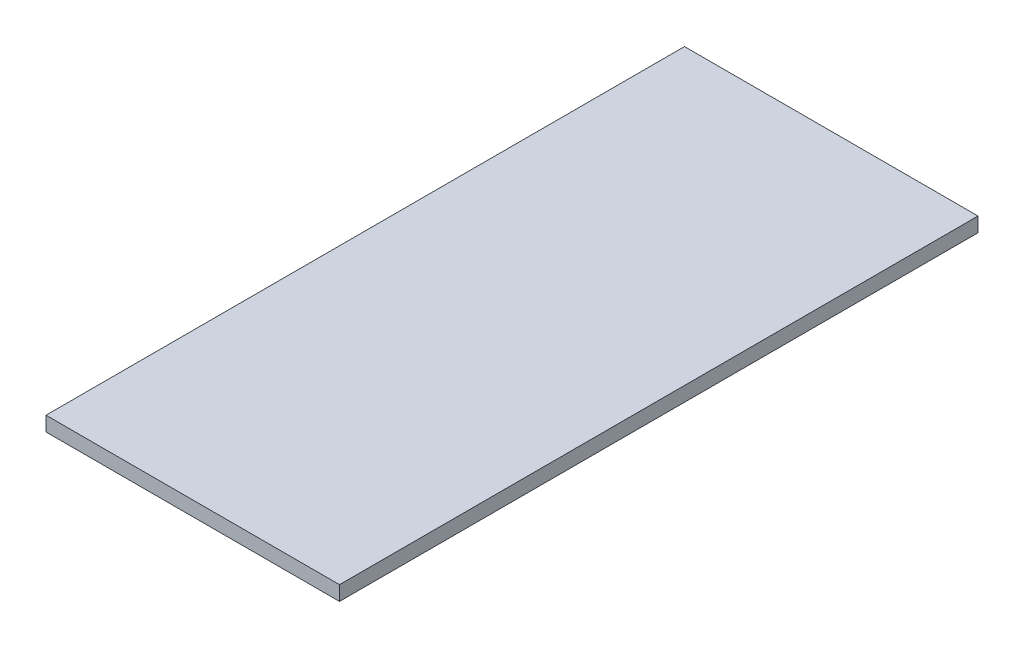
ISO-10303-21;
HEADER;
FILE_DESCRIPTION(('STEP AP214'),'2;1');
FILE_NAME('part.step','',(''),(''),'','','');
FILE_SCHEMA(('AUTOMOTIVE_DESIGN { 1 0 10303 214 1 1 1 1 }'));
ENDSEC;
DATA;
#1=APPLICATION_CONTEXT('core data for automotive mechanical design processes');
#2=APPLICATION_PROTOCOL_DEFINITION('international standard','automotive_design',2000,#1);
#3=PRODUCT_CONTEXT('',#1,'mechanical');
#4=PRODUCT('Part','Part','',(#3));
#5=PRODUCT_RELATED_PRODUCT_CATEGORY('part','',(#4));
#6=PRODUCT_DEFINITION_FORMATION('','',#4);
#7=PRODUCT_DEFINITION_CONTEXT('part definition',#1,'design');
#8=PRODUCT_DEFINITION('design','',#6,#7);
#9=PRODUCT_DEFINITION_SHAPE('','',#8);
#10=(LENGTH_UNIT() NAMED_UNIT(*) SI_UNIT(.MILLI.,.METRE.));
#11=(NAMED_UNIT(*) PLANE_ANGLE_UNIT() SI_UNIT($,.RADIAN.));
#12=(NAMED_UNIT(*) SI_UNIT($,.STERADIAN.) SOLID_ANGLE_UNIT());
#13=UNCERTAINTY_MEASURE_WITH_UNIT(LENGTH_MEASURE(1.E-05),#10,'distance_accuracy_value','');
#14=(GEOMETRIC_REPRESENTATION_CONTEXT(3) GLOBAL_UNCERTAINTY_ASSIGNED_CONTEXT((#13)) GLOBAL_UNIT_ASSIGNED_CONTEXT((#10,
#11,#12)) REPRESENTATION_CONTEXT('',''));
#15=CARTESIAN_POINT('',(0.,0.,0.));
#16=DIRECTION('',(0.,0.,1.));
#17=DIRECTION('',(1.,0.,0.));
#18=AXIS2_PLACEMENT_3D('',#15,#16,#17);
#19=CARTESIAN_POINT('',(-102.69958830056,28.6047144668192,49.1767098548853));
#20=DIRECTION('',(1.,0.,0.));
#21=DIRECTION('',(0.,1.,0.));
#22=AXIS2_PLACEMENT_3D('',#19,#20,#21);
#23=PLANE('',#22);
#24=DIRECTION('',(0.,0.,-1.));
#25=VECTOR('',#24,1.);
#26=CARTESIAN_POINT('',(-102.69958830056,39.6047144668192,49.1767098548853));
#27=LINE('',#26,#25);
#28=CARTESIAN_POINT('',(-102.69958830056,39.6047144668189,531.998452869963));
#29=VERTEX_POINT('',#28);
#30=CARTESIAN_POINT('',(-102.69958830056,39.6047144668192,49.1767098548853));
#31=VERTEX_POINT('',#30);
#32=EDGE_CURVE('E96',#29,#31,#27,.T.);
#33=ORIENTED_EDGE('',*,*,#32,.T.);
#34=DIRECTION('',(0.,1.,0.));
#35=VECTOR('',#34,1.);
#36=CARTESIAN_POINT('',(-102.69958830056,28.6047144668192,49.1767098548853));
#37=LINE('',#36,#35);
#38=CARTESIAN_POINT('',(-102.69958830056,28.6047144668192,49.1767098548853));
#39=VERTEX_POINT('',#38);
#40=EDGE_CURVE('E11',#39,#31,#37,.T.);
#41=ORIENTED_EDGE('',*,*,#40,.F.);
#42=DIRECTION('',(0.,0.,-1.));
#43=VECTOR('',#42,1.);
#44=CARTESIAN_POINT('',(-102.69958830056,28.6047144668192,49.1767098548853));
#45=LINE('',#44,#43);
#46=CARTESIAN_POINT('',(-102.69958830056,28.6047144668189,531.998452869963));
#47=VERTEX_POINT('',#46);
#48=EDGE_CURVE('E84',#47,#39,#45,.T.);
#49=ORIENTED_EDGE('',*,*,#48,.F.);
#50=DIRECTION('',(0.,1.,0.));
#51=VECTOR('',#50,1.);
#52=CARTESIAN_POINT('',(-102.69958830056,28.6047144668189,531.998452869963));
#53=LINE('',#52,#51);
#54=EDGE_CURVE('E92',#47,#29,#53,.T.);
#55=ORIENTED_EDGE('',*,*,#54,.T.);
#56=EDGE_LOOP('',(#33,#41,#49,#55));
#57=FACE_BOUND('',#56,.T.);
#58=ADVANCED_FACE('F33',(#57),#23,.F.);
#59=CARTESIAN_POINT('',(-102.69958830056,28.6047144668192,49.1767098548853));
#60=DIRECTION('',(0.,0.,1.));
#61=DIRECTION('',(0.,-1.,0.));
#62=AXIS2_PLACEMENT_3D('',#59,#60,#61);
#63=PLANE('',#62);
#64=DIRECTION('',(1.,0.,0.));
#65=VECTOR('',#64,1.);
#66=CARTESIAN_POINT('',(-102.69958830056,39.6047144668192,49.1767098548853));
#67=LINE('',#66,#65);
#68=CARTESIAN_POINT('',(119.23441331911,39.6047144668192,49.1767098548853));
#69=VERTEX_POINT('',#68);
#70=EDGE_CURVE('E88',#31,#69,#67,.T.);
#71=ORIENTED_EDGE('',*,*,#70,.T.);
#72=DIRECTION('',(0.,1.,0.));
#73=VECTOR('',#72,1.);
#74=CARTESIAN_POINT('',(119.23441331911,28.6047144668192,49.1767098548853));
#75=LINE('',#74,#73);
#76=CARTESIAN_POINT('',(119.23441331911,28.6047144668192,49.1767098548853));
#77=VERTEX_POINT('',#76);
#78=EDGE_CURVE('E41',#77,#69,#75,.T.);
#79=ORIENTED_EDGE('',*,*,#78,.F.);
#80=DIRECTION('',(1.,0.,0.));
#81=VECTOR('',#80,1.);
#82=CARTESIAN_POINT('',(-102.69958830056,28.6047144668192,49.1767098548853));
#83=LINE('',#82,#81);
#84=EDGE_CURVE('E79',#39,#77,#83,.T.);
#85=ORIENTED_EDGE('',*,*,#84,.F.);
#86=ORIENTED_EDGE('',*,*,#40,.T.);
#87=EDGE_LOOP('',(#71,#79,#85,#86));
#88=FACE_BOUND('',#87,.T.);
#89=ADVANCED_FACE('F87',(#88),#63,.F.);
#90=CARTESIAN_POINT('',(119.23441331911,28.6047144668192,49.1767098548853));
#91=DIRECTION('',(-1.,0.,0.));
#92=DIRECTION('',(0.,-1.,0.));
#93=AXIS2_PLACEMENT_3D('',#90,#91,#92);
#94=PLANE('',#93);
#95=DIRECTION('',(0.,0.,1.));
#96=VECTOR('',#95,1.);
#97=CARTESIAN_POINT('',(119.23441331911,39.6047144668192,49.1767098548853));
#98=LINE('',#97,#96);
#99=CARTESIAN_POINT('',(119.23441331911,39.604714466819,531.998452869963));
#100=VERTEX_POINT('',#99);
#101=EDGE_CURVE('E66',#69,#100,#98,.T.);
#102=ORIENTED_EDGE('',*,*,#101,.T.);
#103=DIRECTION('',(0.,1.,0.));
#104=VECTOR('',#103,1.);
#105=CARTESIAN_POINT('',(119.23441331911,28.604714466819,531.998452869963));
#106=LINE('',#105,#104);
#107=CARTESIAN_POINT('',(119.23441331911,28.604714466819,531.998452869963));
#108=VERTEX_POINT('',#107);
#109=EDGE_CURVE('E89',#108,#100,#106,.T.);
#110=ORIENTED_EDGE('',*,*,#109,.F.);
#111=DIRECTION('',(0.,0.,1.));
#112=VECTOR('',#111,1.);
#113=CARTESIAN_POINT('',(119.23441331911,28.6047144668192,49.1767098548853));
#114=LINE('',#113,#112);
#115=EDGE_CURVE('E82',#77,#108,#114,.T.);
#116=ORIENTED_EDGE('',*,*,#115,.F.);
#117=ORIENTED_EDGE('',*,*,#78,.T.);
#118=EDGE_LOOP('',(#102,#110,#116,#117));
#119=FACE_BOUND('',#118,.T.);
#120=ADVANCED_FACE('F90',(#119),#94,.F.);
#121=CARTESIAN_POINT('',(-102.69958830056,28.6047144668189,531.998452869963));
#122=DIRECTION('',(0.,0.,-1.));
#123=DIRECTION('',(0.,1.,0.));
#124=AXIS2_PLACEMENT_3D('',#121,#122,#123);
#125=PLANE('',#124);
#126=DIRECTION('',(-1.,0.,0.));
#127=VECTOR('',#126,1.);
#128=CARTESIAN_POINT('',(-102.69958830056,39.6047144668189,531.998452869963));
#129=LINE('',#128,#127);
#130=EDGE_CURVE('E72',#100,#29,#129,.T.);
#131=ORIENTED_EDGE('',*,*,#130,.T.);
#132=ORIENTED_EDGE('',*,*,#54,.F.);
#133=DIRECTION('',(-1.,0.,0.));
#134=VECTOR('',#133,1.);
#135=CARTESIAN_POINT('',(-102.69958830056,28.6047144668189,531.998452869963));
#136=LINE('',#135,#134);
#137=EDGE_CURVE('E49',#108,#47,#136,.T.);
#138=ORIENTED_EDGE('',*,*,#137,.F.);
#139=ORIENTED_EDGE('',*,*,#109,.T.);
#140=EDGE_LOOP('',(#131,#132,#138,#139));
#141=FACE_BOUND('',#140,.T.);
#142=ADVANCED_FACE('F103',(#141),#125,.F.);
#143=CARTESIAN_POINT('',(0.,28.6047144668192,0.));
#144=DIRECTION('',(0.,1.,0.));
#145=DIRECTION('',(0.,0.,1.));
#146=AXIS2_PLACEMENT_3D('',#143,#144,#145);
#147=PLANE('',#146);
#148=ORIENTED_EDGE('',*,*,#48,.T.);
#149=ORIENTED_EDGE('',*,*,#84,.T.);
#150=ORIENTED_EDGE('',*,*,#115,.T.);
#151=ORIENTED_EDGE('',*,*,#137,.T.);
#152=EDGE_LOOP('',(#148,#149,#150,#151));
#153=FACE_BOUND('',#152,.T.);
#154=ADVANCED_FACE('F80',(#153),#147,.F.);
#155=CARTESIAN_POINT('',(0.,39.6047144668192,0.));
#156=DIRECTION('',(0.,1.,0.));
#157=DIRECTION('',(0.,0.,1.));
#158=AXIS2_PLACEMENT_3D('',#155,#156,#157);
#159=PLANE('',#158);
#160=ORIENTED_EDGE('',*,*,#32,.F.);
#161=ORIENTED_EDGE('',*,*,#130,.F.);
#162=ORIENTED_EDGE('',*,*,#101,.F.);
#163=ORIENTED_EDGE('',*,*,#70,.F.);
#164=EDGE_LOOP('',(#160,#161,#162,#163));
#165=FACE_BOUND('',#164,.T.);
#166=ADVANCED_FACE('F106',(#165),#159,.T.);
#167=CLOSED_SHELL('',(#58,#89,#120,#142,#154,#166));
#168=MANIFOLD_SOLID_BREP('B2',#167);
#169=ADVANCED_BREP_SHAPE_REPRESENTATION('',(#18,#168),#14);
#170=SHAPE_DEFINITION_REPRESENTATION(#9,#169);
ENDSEC;
END-ISO-10303-21;
